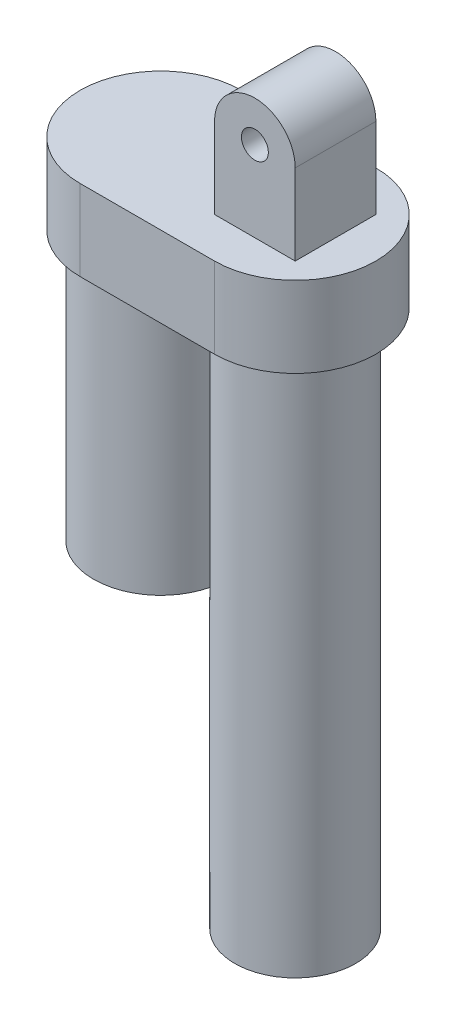
ISO-10303-21;
HEADER;
FILE_DESCRIPTION(('STEP AP214'),'2;1');
FILE_NAME('part.step','',(''),(''),'','','');
FILE_SCHEMA(('AUTOMOTIVE_DESIGN { 1 0 10303 214 1 1 1 1 }'));
ENDSEC;
DATA;
#1=APPLICATION_CONTEXT('core data for automotive mechanical design processes');
#2=APPLICATION_PROTOCOL_DEFINITION('international standard','automotive_design',2000,#1);
#3=PRODUCT_CONTEXT('',#1,'mechanical');
#4=PRODUCT('Part','Part','',(#3));
#5=PRODUCT_RELATED_PRODUCT_CATEGORY('part','',(#4));
#6=PRODUCT_DEFINITION_FORMATION('','',#4);
#7=PRODUCT_DEFINITION_CONTEXT('part definition',#1,'design');
#8=PRODUCT_DEFINITION('design','',#6,#7);
#9=PRODUCT_DEFINITION_SHAPE('','',#8);
#10=(LENGTH_UNIT() NAMED_UNIT(*) SI_UNIT(.MILLI.,.METRE.));
#11=(NAMED_UNIT(*) PLANE_ANGLE_UNIT() SI_UNIT($,.RADIAN.));
#12=(NAMED_UNIT(*) SI_UNIT($,.STERADIAN.) SOLID_ANGLE_UNIT());
#13=UNCERTAINTY_MEASURE_WITH_UNIT(LENGTH_MEASURE(1.E-05),#10,'distance_accuracy_value','');
#14=(GEOMETRIC_REPRESENTATION_CONTEXT(3) GLOBAL_UNCERTAINTY_ASSIGNED_CONTEXT((#13)) GLOBAL_UNIT_ASSIGNED_CONTEXT((#10,
#11,#12)) REPRESENTATION_CONTEXT('',''));
#15=CARTESIAN_POINT('',(0.,0.,0.));
#16=DIRECTION('',(0.,0.,1.));
#17=DIRECTION('',(1.,0.,0.));
#18=AXIS2_PLACEMENT_3D('',#15,#16,#17);
#19=CARTESIAN_POINT('',(0.,230.,0.));
#20=DIRECTION('',(0.,1.,0.));
#21=DIRECTION('',(0.,0.,1.));
#22=AXIS2_PLACEMENT_3D('',#19,#20,#21);
#23=PLANE('',#22);
#24=CARTESIAN_POINT('',(0.,230.,0.));
#25=DIRECTION('',(0.,1.,0.));
#26=DIRECTION('',(0.,0.,1.));
#27=AXIS2_PLACEMENT_3D('',#24,#25,#26);
#28=CIRCLE('',#27,30.);
#29=CARTESIAN_POINT('',(0.,230.,30.));
#30=VERTEX_POINT('',#29);
#31=CARTESIAN_POINT('',(0.,230.,-30.));
#32=VERTEX_POINT('',#31);
#33=EDGE_CURVE('E141',#30,#32,#28,.T.);
#34=ORIENTED_EDGE('',*,*,#33,.T.);
#35=DIRECTION('',(-1.,0.,0.));
#36=VECTOR('',#35,1.);
#37=CARTESIAN_POINT('',(0.,230.,-30.));
#38=LINE('',#37,#36);
#39=CARTESIAN_POINT('',(-50.,230.,-30.));
#40=VERTEX_POINT('',#39);
#41=EDGE_CURVE('E87',#32,#40,#38,.T.);
#42=ORIENTED_EDGE('',*,*,#41,.T.);
#43=CARTESIAN_POINT('',(-50.,230.,0.));
#44=DIRECTION('',(0.,1.,0.));
#45=DIRECTION('',(0.,0.,1.));
#46=AXIS2_PLACEMENT_3D('',#43,#44,#45);
#47=CIRCLE('',#46,30.);
#48=CARTESIAN_POINT('',(-50.,230.,30.));
#49=VERTEX_POINT('',#48);
#50=EDGE_CURVE('E144',#40,#49,#47,.T.);
#51=ORIENTED_EDGE('',*,*,#50,.T.);
#52=DIRECTION('',(1.,0.,0.));
#53=VECTOR('',#52,1.);
#54=CARTESIAN_POINT('',(0.,230.,30.));
#55=LINE('',#54,#53);
#56=EDGE_CURVE('E58',#49,#30,#55,.T.);
#57=ORIENTED_EDGE('',*,*,#56,.T.);
#58=EDGE_LOOP('',(#34,#42,#51,#57));
#59=FACE_BOUND('',#58,.T.);
#60=DIRECTION('',(1.,0.,0.));
#61=VECTOR('',#60,1.);
#62=CARTESIAN_POINT('',(15.,230.,-15.));
#63=LINE('',#62,#61);
#64=CARTESIAN_POINT('',(-15.,230.,-15.));
#65=VERTEX_POINT('',#64);
#66=CARTESIAN_POINT('',(15.,230.,-15.));
#67=VERTEX_POINT('',#66);
#68=EDGE_CURVE('E49',#65,#67,#63,.T.);
#69=ORIENTED_EDGE('',*,*,#68,.T.);
#70=DIRECTION('',(0.,0.,-1.));
#71=VECTOR('',#70,1.);
#72=CARTESIAN_POINT('',(15.,230.,15.));
#73=LINE('',#72,#71);
#74=CARTESIAN_POINT('',(15.,230.,15.));
#75=VERTEX_POINT('',#74);
#76=EDGE_CURVE('E114',#75,#67,#73,.T.);
#77=ORIENTED_EDGE('',*,*,#76,.F.);
#78=DIRECTION('',(1.,0.,0.));
#79=VECTOR('',#78,1.);
#80=CARTESIAN_POINT('',(15.,230.,15.));
#81=LINE('',#80,#79);
#82=CARTESIAN_POINT('',(-15.,230.,15.));
#83=VERTEX_POINT('',#82);
#84=EDGE_CURVE('E120',#83,#75,#81,.T.);
#85=ORIENTED_EDGE('',*,*,#84,.F.);
#86=DIRECTION('',(0.,0.,-1.));
#87=VECTOR('',#86,1.);
#88=CARTESIAN_POINT('',(-15.,230.,15.));
#89=LINE('',#88,#87);
#90=EDGE_CURVE('E268',#83,#65,#89,.T.);
#91=ORIENTED_EDGE('',*,*,#90,.T.);
#92=EDGE_LOOP('',(#69,#77,#85,#91));
#93=FACE_BOUND('',#92,.T.);
#94=ADVANCED_FACE('F34',(#59,#93),#23,.T.);
#95=CARTESIAN_POINT('',(0.,200.,0.));
#96=DIRECTION('',(0.,1.,0.));
#97=DIRECTION('',(0.,0.,1.));
#98=AXIS2_PLACEMENT_3D('',#95,#96,#97);
#99=PLANE('',#98);
#100=CARTESIAN_POINT('',(0.,200.,0.));
#101=DIRECTION('',(0.,1.,0.));
#102=DIRECTION('',(0.,0.,1.));
#103=AXIS2_PLACEMENT_3D('',#100,#101,#102);
#104=CIRCLE('',#103,30.);
#105=CARTESIAN_POINT('',(0.,200.,30.));
#106=VERTEX_POINT('',#105);
#107=CARTESIAN_POINT('',(0.,200.,-30.));
#108=VERTEX_POINT('',#107);
#109=EDGE_CURVE('E135',#106,#108,#104,.T.);
#110=ORIENTED_EDGE('',*,*,#109,.F.);
#111=DIRECTION('',(1.,0.,0.));
#112=VECTOR('',#111,1.);
#113=CARTESIAN_POINT('',(0.,200.,30.));
#114=LINE('',#113,#112);
#115=CARTESIAN_POINT('',(-50.,200.,30.));
#116=VERTEX_POINT('',#115);
#117=EDGE_CURVE('E79',#116,#106,#114,.T.);
#118=ORIENTED_EDGE('',*,*,#117,.F.);
#119=CARTESIAN_POINT('',(-50.,200.,0.));
#120=DIRECTION('',(0.,1.,0.));
#121=DIRECTION('',(0.,0.,1.));
#122=AXIS2_PLACEMENT_3D('',#119,#120,#121);
#123=CIRCLE('',#122,30.);
#124=CARTESIAN_POINT('',(-50.,200.,-30.));
#125=VERTEX_POINT('',#124);
#126=EDGE_CURVE('E152',#125,#116,#123,.T.);
#127=ORIENTED_EDGE('',*,*,#126,.F.);
#128=DIRECTION('',(-1.,0.,0.));
#129=VECTOR('',#128,1.);
#130=CARTESIAN_POINT('',(0.,200.,-30.));
#131=LINE('',#130,#129);
#132=EDGE_CURVE('E150',#108,#125,#131,.T.);
#133=ORIENTED_EDGE('',*,*,#132,.F.);
#134=EDGE_LOOP('',(#110,#118,#127,#133));
#135=FACE_BOUND('',#134,.T.);
#136=CARTESIAN_POINT('',(0.,200.,0.));
#137=DIRECTION('',(0.,1.,0.));
#138=DIRECTION('',(0.,0.,1.));
#139=AXIS2_PLACEMENT_3D('',#136,#137,#138);
#140=CIRCLE('',#139,22.5);
#141=CARTESIAN_POINT('',(0.,200.,22.5));
#142=VERTEX_POINT('',#141);
#143=EDGE_CURVE('E163',#142,#142,#140,.F.);
#144=ORIENTED_EDGE('',*,*,#143,.F.);
#145=EDGE_LOOP('',(#144));
#146=FACE_BOUND('',#145,.T.);
#147=CARTESIAN_POINT('',(-50.,200.,0.));
#148=DIRECTION('',(0.,1.,0.));
#149=DIRECTION('',(0.,0.,1.));
#150=AXIS2_PLACEMENT_3D('',#147,#148,#149);
#151=CIRCLE('',#150,25.);
#152=CARTESIAN_POINT('',(-50.,200.,25.));
#153=VERTEX_POINT('',#152);
#154=EDGE_CURVE('E11',#153,#153,#151,.F.);
#155=ORIENTED_EDGE('',*,*,#154,.F.);
#156=EDGE_LOOP('',(#155));
#157=FACE_BOUND('',#156,.T.);
#158=ADVANCED_FACE('F186',(#135,#146,#157),#99,.F.);
#159=CARTESIAN_POINT('',(0.,0.,0.));
#160=DIRECTION('',(0.,-1.,0.));
#161=DIRECTION('',(0.,0.,-1.));
#162=AXIS2_PLACEMENT_3D('',#159,#160,#161);
#163=CYLINDRICAL_SURFACE('',#162,22.5);
#164=ORIENTED_EDGE('',*,*,#143,.T.);
#165=EDGE_LOOP('',(#164));
#166=FACE_BOUND('',#165,.T.);
#167=CARTESIAN_POINT('',(0.,0.,0.));
#168=DIRECTION('',(0.,-1.,0.));
#169=DIRECTION('',(0.,0.,-1.));
#170=AXIS2_PLACEMENT_3D('',#167,#168,#169);
#171=CIRCLE('',#170,22.5);
#172=CARTESIAN_POINT('',(0.,0.,-22.5));
#173=VERTEX_POINT('',#172);
#174=EDGE_CURVE('E166',#173,#173,#171,.T.);
#175=ORIENTED_EDGE('',*,*,#174,.F.);
#176=EDGE_LOOP('',(#175));
#177=FACE_BOUND('',#176,.T.);
#178=ADVANCED_FACE('F36',(#166,#177),#163,.T.);
#179=CARTESIAN_POINT('',(0.,0.,0.));
#180=DIRECTION('',(0.,-1.,0.));
#181=DIRECTION('',(0.,0.,-1.));
#182=AXIS2_PLACEMENT_3D('',#179,#180,#181);
#183=CYLINDRICAL_SURFACE('',#182,9.00000000000002);
#184=CARTESIAN_POINT('',(0.,0.,0.));
#185=DIRECTION('',(0.,-1.,0.));
#186=DIRECTION('',(0.,0.,-1.));
#187=AXIS2_PLACEMENT_3D('',#184,#185,#186);
#188=CIRCLE('',#187,9.00000000000003);
#189=CARTESIAN_POINT('',(0.,0.,-9.00000000000003));
#190=VERTEX_POINT('',#189);
#191=EDGE_CURVE('E169',#190,#190,#188,.T.);
#192=ORIENTED_EDGE('',*,*,#191,.T.);
#193=EDGE_LOOP('',(#192));
#194=FACE_BOUND('',#193,.T.);
#195=CARTESIAN_POINT('',(0.,200.,0.));
#196=DIRECTION('',(0.,-1.,0.));
#197=DIRECTION('',(0.,0.,-1.));
#198=AXIS2_PLACEMENT_3D('',#195,#196,#197);
#199=CIRCLE('',#198,9.00000000000002);
#200=CARTESIAN_POINT('',(0.,200.,-9.00000000000002));
#201=VERTEX_POINT('',#200);
#202=EDGE_CURVE('E42',#201,#201,#199,.T.);
#203=ORIENTED_EDGE('',*,*,#202,.F.);
#204=EDGE_LOOP('',(#203));
#205=FACE_BOUND('',#204,.T.);
#206=ADVANCED_FACE('F176',(#194,#205),#183,.F.);
#207=CARTESIAN_POINT('',(9.00000000000003,0.,0.));
#208=DIRECTION('',(0.,-1.,0.));
#209=DIRECTION('',(0.,0.,-1.));
#210=AXIS2_PLACEMENT_3D('',#207,#208,#209);
#211=PLANE('',#210);
#212=ORIENTED_EDGE('',*,*,#174,.T.);
#213=EDGE_LOOP('',(#212));
#214=FACE_BOUND('',#213,.T.);
#215=ORIENTED_EDGE('',*,*,#191,.F.);
#216=EDGE_LOOP('',(#215));
#217=FACE_BOUND('',#216,.T.);
#218=ADVANCED_FACE('F178',(#214,#217),#211,.T.);
#219=ORIENTED_EDGE('',*,*,#202,.T.);
#220=EDGE_LOOP('',(#219));
#221=FACE_BOUND('',#220,.T.);
#222=ADVANCED_FACE('F174',(#221),#99,.F.);
#223=CARTESIAN_POINT('',(0.,230.,0.));
#224=DIRECTION('',(0.,-1.,0.));
#225=DIRECTION('',(0.,0.,-1.));
#226=AXIS2_PLACEMENT_3D('',#223,#224,#225);
#227=CYLINDRICAL_SURFACE('',#226,30.);
#228=ORIENTED_EDGE('',*,*,#109,.T.);
#229=DIRECTION('',(0.,-1.,0.));
#230=VECTOR('',#229,1.);
#231=CARTESIAN_POINT('',(0.,230.,-30.));
#232=LINE('',#231,#230);
#233=EDGE_CURVE('E161',#32,#108,#232,.T.);
#234=ORIENTED_EDGE('',*,*,#233,.F.);
#235=ORIENTED_EDGE('',*,*,#33,.F.);
#236=DIRECTION('',(0.,-1.,0.));
#237=VECTOR('',#236,1.);
#238=CARTESIAN_POINT('',(0.,230.,30.));
#239=LINE('',#238,#237);
#240=EDGE_CURVE('E147',#30,#106,#239,.T.);
#241=ORIENTED_EDGE('',*,*,#240,.T.);
#242=EDGE_LOOP('',(#228,#234,#235,#241));
#243=FACE_BOUND('',#242,.T.);
#244=ADVANCED_FACE('F200',(#243),#227,.T.);
#245=CARTESIAN_POINT('',(0.,230.,-30.));
#246=DIRECTION('',(0.,0.,1.));
#247=DIRECTION('',(1.,0.,0.));
#248=AXIS2_PLACEMENT_3D('',#245,#246,#247);
#249=PLANE('',#248);
#250=ORIENTED_EDGE('',*,*,#132,.T.);
#251=DIRECTION('',(0.,-1.,0.));
#252=VECTOR('',#251,1.);
#253=CARTESIAN_POINT('',(-50.,230.,-30.));
#254=LINE('',#253,#252);
#255=EDGE_CURVE('E158',#40,#125,#254,.T.);
#256=ORIENTED_EDGE('',*,*,#255,.F.);
#257=ORIENTED_EDGE('',*,*,#41,.F.);
#258=ORIENTED_EDGE('',*,*,#233,.T.);
#259=EDGE_LOOP('',(#250,#256,#257,#258));
#260=FACE_BOUND('',#259,.T.);
#261=ADVANCED_FACE('F207',(#260),#249,.F.);
#262=CARTESIAN_POINT('',(-50.,230.,0.));
#263=DIRECTION('',(0.,-1.,0.));
#264=DIRECTION('',(0.,0.,-1.));
#265=AXIS2_PLACEMENT_3D('',#262,#263,#264);
#266=CYLINDRICAL_SURFACE('',#265,30.);
#267=ORIENTED_EDGE('',*,*,#126,.T.);
#268=DIRECTION('',(0.,-1.,0.));
#269=VECTOR('',#268,1.);
#270=CARTESIAN_POINT('',(-50.,230.,30.));
#271=LINE('',#270,#269);
#272=EDGE_CURVE('E156',#49,#116,#271,.T.);
#273=ORIENTED_EDGE('',*,*,#272,.F.);
#274=ORIENTED_EDGE('',*,*,#50,.F.);
#275=ORIENTED_EDGE('',*,*,#255,.T.);
#276=EDGE_LOOP('',(#267,#273,#274,#275));
#277=FACE_BOUND('',#276,.T.);
#278=ADVANCED_FACE('F204',(#277),#266,.T.);
#279=CARTESIAN_POINT('',(0.,230.,30.));
#280=DIRECTION('',(0.,0.,-1.));
#281=DIRECTION('',(-1.,0.,0.));
#282=AXIS2_PLACEMENT_3D('',#279,#280,#281);
#283=PLANE('',#282);
#284=ORIENTED_EDGE('',*,*,#117,.T.);
#285=ORIENTED_EDGE('',*,*,#240,.F.);
#286=ORIENTED_EDGE('',*,*,#56,.F.);
#287=ORIENTED_EDGE('',*,*,#272,.T.);
#288=EDGE_LOOP('',(#284,#285,#286,#287));
#289=FACE_BOUND('',#288,.T.);
#290=ADVANCED_FACE('F201',(#289),#283,.F.);
#291=CARTESIAN_POINT('',(-50.,200.,0.));
#292=DIRECTION('',(0.,1.,0.));
#293=DIRECTION('',(0.,0.,1.));
#294=AXIS2_PLACEMENT_3D('',#291,#292,#293);
#295=CYLINDRICAL_SURFACE('',#294,25.);
#296=ORIENTED_EDGE('',*,*,#154,.T.);
#297=EDGE_LOOP('',(#296));
#298=FACE_BOUND('',#297,.T.);
#299=CARTESIAN_POINT('',(-50.,100.,0.));
#300=DIRECTION('',(0.,1.,0.));
#301=DIRECTION('',(0.,0.,1.));
#302=AXIS2_PLACEMENT_3D('',#299,#300,#301);
#303=CIRCLE('',#302,25.);
#304=CARTESIAN_POINT('',(-50.,100.,25.));
#305=VERTEX_POINT('',#304);
#306=EDGE_CURVE('E132',#305,#305,#303,.T.);
#307=ORIENTED_EDGE('',*,*,#306,.T.);
#308=EDGE_LOOP('',(#307));
#309=FACE_BOUND('',#308,.T.);
#310=ADVANCED_FACE('F196',(#298,#309),#295,.T.);
#311=CARTESIAN_POINT('',(-25.,100.,0.));
#312=DIRECTION('',(0.,1.,0.));
#313=DIRECTION('',(0.,0.,1.));
#314=AXIS2_PLACEMENT_3D('',#311,#312,#313);
#315=PLANE('',#314);
#316=ORIENTED_EDGE('',*,*,#306,.F.);
#317=EDGE_LOOP('',(#316));
#318=FACE_BOUND('',#317,.T.);
#319=ADVANCED_FACE('F228',(#318),#315,.F.);
#320=CARTESIAN_POINT('',(0.,260.,15.));
#321=DIRECTION('',(0.,0.,1.));
#322=DIRECTION('',(1.,0.,0.));
#323=AXIS2_PLACEMENT_3D('',#320,#321,#322);
#324=PLANE('',#323);
#325=ORIENTED_EDGE('',*,*,#84,.T.);
#326=DIRECTION('',(0.,1.,0.));
#327=VECTOR('',#326,1.);
#328=CARTESIAN_POINT('',(15.,230.,15.));
#329=LINE('',#328,#327);
#330=CARTESIAN_POINT('',(15.,260.,15.));
#331=VERTEX_POINT('',#330);
#332=EDGE_CURVE('E110',#75,#331,#329,.T.);
#333=ORIENTED_EDGE('',*,*,#332,.T.);
#334=CARTESIAN_POINT('',(0.,260.,15.));
#335=DIRECTION('',(0.,0.,1.));
#336=DIRECTION('',(1.,0.,0.));
#337=AXIS2_PLACEMENT_3D('',#334,#335,#336);
#338=CIRCLE('',#337,15.);
#339=CARTESIAN_POINT('',(-15.,260.,15.));
#340=VERTEX_POINT('',#339);
#341=EDGE_CURVE('E119',#331,#340,#338,.T.);
#342=ORIENTED_EDGE('',*,*,#341,.T.);
#343=DIRECTION('',(0.,-1.,0.));
#344=VECTOR('',#343,1.);
#345=CARTESIAN_POINT('',(-15.,230.,15.));
#346=LINE('',#345,#344);
#347=EDGE_CURVE('E126',#340,#83,#346,.T.);
#348=ORIENTED_EDGE('',*,*,#347,.T.);
#349=EDGE_LOOP('',(#325,#333,#342,#348));
#350=FACE_BOUND('',#349,.T.);
#351=CARTESIAN_POINT('',(0.,260.,15.));
#352=DIRECTION('',(0.,0.,1.));
#353=DIRECTION('',(1.,0.,0.));
#354=AXIS2_PLACEMENT_3D('',#351,#352,#353);
#355=CIRCLE('',#354,5.00000000000001);
#356=CARTESIAN_POINT('',(5.00000000000001,260.,15.));
#357=VERTEX_POINT('',#356);
#358=EDGE_CURVE('E258',#357,#357,#355,.T.);
#359=ORIENTED_EDGE('',*,*,#358,.F.);
#360=EDGE_LOOP('',(#359));
#361=FACE_BOUND('',#360,.T.);
#362=ADVANCED_FACE('F123',(#350,#361),#324,.T.);
#363=CARTESIAN_POINT('',(0.,260.,-15.));
#364=DIRECTION('',(0.,0.,1.));
#365=DIRECTION('',(1.,0.,0.));
#366=AXIS2_PLACEMENT_3D('',#363,#364,#365);
#367=PLANE('',#366);
#368=ORIENTED_EDGE('',*,*,#68,.F.);
#369=DIRECTION('',(0.,-1.,0.));
#370=VECTOR('',#369,1.);
#371=CARTESIAN_POINT('',(-15.,230.,-15.));
#372=LINE('',#371,#370);
#373=CARTESIAN_POINT('',(-15.,260.,-15.));
#374=VERTEX_POINT('',#373);
#375=EDGE_CURVE('E130',#374,#65,#372,.T.);
#376=ORIENTED_EDGE('',*,*,#375,.F.);
#377=CARTESIAN_POINT('',(0.,260.,-15.));
#378=DIRECTION('',(0.,0.,1.));
#379=DIRECTION('',(1.,0.,0.));
#380=AXIS2_PLACEMENT_3D('',#377,#378,#379);
#381=CIRCLE('',#380,15.);
#382=CARTESIAN_POINT('',(15.,260.,-15.));
#383=VERTEX_POINT('',#382);
#384=EDGE_CURVE('E272',#383,#374,#381,.T.);
#385=ORIENTED_EDGE('',*,*,#384,.F.);
#386=DIRECTION('',(0.,1.,0.));
#387=VECTOR('',#386,1.);
#388=CARTESIAN_POINT('',(15.,230.,-15.));
#389=LINE('',#388,#387);
#390=EDGE_CURVE('E270',#67,#383,#389,.T.);
#391=ORIENTED_EDGE('',*,*,#390,.F.);
#392=EDGE_LOOP('',(#368,#376,#385,#391));
#393=FACE_BOUND('',#392,.T.);
#394=CARTESIAN_POINT('',(0.,260.,-15.));
#395=DIRECTION('',(0.,0.,1.));
#396=DIRECTION('',(1.,0.,0.));
#397=AXIS2_PLACEMENT_3D('',#394,#395,#396);
#398=CIRCLE('',#397,5.00000000000001);
#399=CARTESIAN_POINT('',(5.00000000000001,260.,-15.));
#400=VERTEX_POINT('',#399);
#401=EDGE_CURVE('E261',#400,#400,#398,.T.);
#402=ORIENTED_EDGE('',*,*,#401,.T.);
#403=EDGE_LOOP('',(#402));
#404=FACE_BOUND('',#403,.T.);
#405=ADVANCED_FACE('F235',(#393,#404),#367,.F.);
#406=CARTESIAN_POINT('',(15.,230.,15.));
#407=DIRECTION('',(-1.,0.,0.));
#408=DIRECTION('',(0.,0.,1.));
#409=AXIS2_PLACEMENT_3D('',#406,#407,#408);
#410=PLANE('',#409);
#411=ORIENTED_EDGE('',*,*,#390,.T.);
#412=DIRECTION('',(0.,0.,-1.));
#413=VECTOR('',#412,1.);
#414=CARTESIAN_POINT('',(15.,260.,15.));
#415=LINE('',#414,#413);
#416=EDGE_CURVE('E116',#331,#383,#415,.T.);
#417=ORIENTED_EDGE('',*,*,#416,.F.);
#418=ORIENTED_EDGE('',*,*,#332,.F.);
#419=ORIENTED_EDGE('',*,*,#76,.T.);
#420=EDGE_LOOP('',(#411,#417,#418,#419));
#421=FACE_BOUND('',#420,.T.);
#422=ADVANCED_FACE('F112',(#421),#410,.F.);
#423=CARTESIAN_POINT('',(0.,260.,15.));
#424=DIRECTION('',(0.,0.,-1.));
#425=DIRECTION('',(-1.,0.,0.));
#426=AXIS2_PLACEMENT_3D('',#423,#424,#425);
#427=CYLINDRICAL_SURFACE('',#426,15.);
#428=ORIENTED_EDGE('',*,*,#384,.T.);
#429=DIRECTION('',(0.,0.,-1.));
#430=VECTOR('',#429,1.);
#431=CARTESIAN_POINT('',(-15.,260.,15.));
#432=LINE('',#431,#430);
#433=EDGE_CURVE('E137',#340,#374,#432,.T.);
#434=ORIENTED_EDGE('',*,*,#433,.F.);
#435=ORIENTED_EDGE('',*,*,#341,.F.);
#436=ORIENTED_EDGE('',*,*,#416,.T.);
#437=EDGE_LOOP('',(#428,#434,#435,#436));
#438=FACE_BOUND('',#437,.T.);
#439=ADVANCED_FACE('F240',(#438),#427,.T.);
#440=CARTESIAN_POINT('',(-15.,230.,15.));
#441=DIRECTION('',(1.,0.,0.));
#442=DIRECTION('',(0.,1.,0.));
#443=AXIS2_PLACEMENT_3D('',#440,#441,#442);
#444=PLANE('',#443);
#445=ORIENTED_EDGE('',*,*,#375,.T.);
#446=ORIENTED_EDGE('',*,*,#90,.F.);
#447=ORIENTED_EDGE('',*,*,#347,.F.);
#448=ORIENTED_EDGE('',*,*,#433,.T.);
#449=EDGE_LOOP('',(#445,#446,#447,#448));
#450=FACE_BOUND('',#449,.T.);
#451=ADVANCED_FACE('F243',(#450),#444,.F.);
#452=CARTESIAN_POINT('',(0.,260.,15.));
#453=DIRECTION('',(0.,0.,-1.));
#454=DIRECTION('',(-1.,0.,0.));
#455=AXIS2_PLACEMENT_3D('',#452,#453,#454);
#456=CYLINDRICAL_SURFACE('',#455,5.00000000000001);
#457=ORIENTED_EDGE('',*,*,#358,.T.);
#458=EDGE_LOOP('',(#457));
#459=FACE_BOUND('',#458,.T.);
#460=ORIENTED_EDGE('',*,*,#401,.F.);
#461=EDGE_LOOP('',(#460));
#462=FACE_BOUND('',#461,.T.);
#463=ADVANCED_FACE('F247',(#459,#462),#456,.F.);
#464=CLOSED_SHELL('',(#94,#158,#178,#206,#218,#222,#244,#261,#278,#290,#310,#319,#362,#405,#422,
#439,#451,#463));
#465=MANIFOLD_SOLID_BREP('B2',#464);
#466=ADVANCED_BREP_SHAPE_REPRESENTATION('',(#18,#465),#14);
#467=SHAPE_DEFINITION_REPRESENTATION(#9,#466);
ENDSEC;
END-ISO-10303-21;
